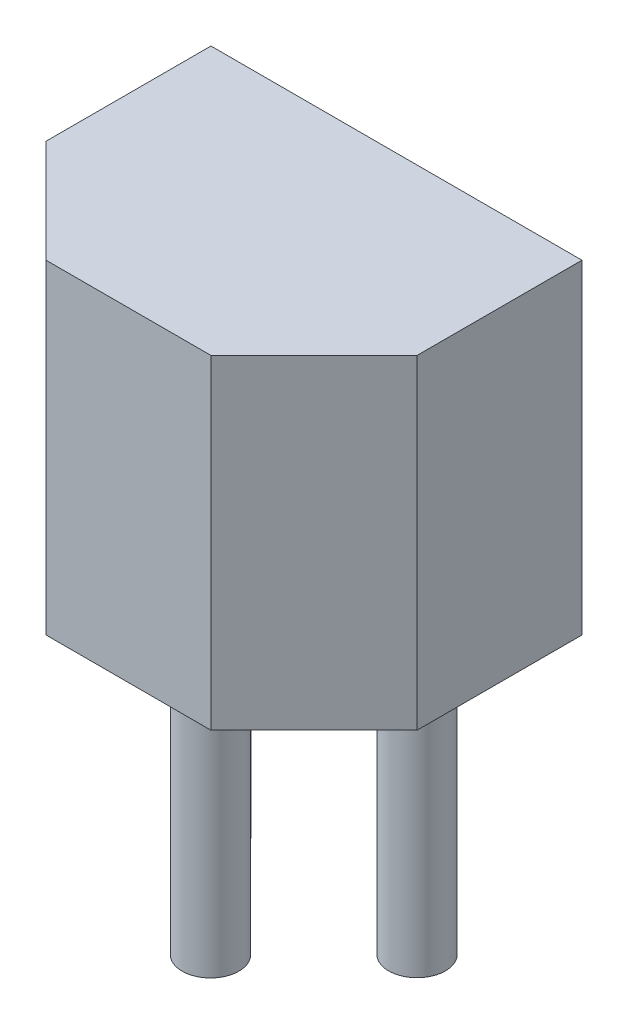
ISO-10303-21;
HEADER;
FILE_DESCRIPTION(('STEP AP214'),'2;1');
FILE_NAME('part.step','',(''),(''),'','','');
FILE_SCHEMA(('AUTOMOTIVE_DESIGN { 1 0 10303 214 1 1 1 1 }'));
ENDSEC;
DATA;
#1=APPLICATION_CONTEXT('core data for automotive mechanical design processes');
#2=APPLICATION_PROTOCOL_DEFINITION('international standard','automotive_design',2000,#1);
#3=PRODUCT_CONTEXT('',#1,'mechanical');
#4=PRODUCT('Part','Part','',(#3));
#5=PRODUCT_RELATED_PRODUCT_CATEGORY('part','',(#4));
#6=PRODUCT_DEFINITION_FORMATION('','',#4);
#7=PRODUCT_DEFINITION_CONTEXT('part definition',#1,'design');
#8=PRODUCT_DEFINITION('design','',#6,#7);
#9=PRODUCT_DEFINITION_SHAPE('','',#8);
#10=(LENGTH_UNIT() NAMED_UNIT(*) SI_UNIT(.MILLI.,.METRE.));
#11=(NAMED_UNIT(*) PLANE_ANGLE_UNIT() SI_UNIT($,.RADIAN.));
#12=(NAMED_UNIT(*) SI_UNIT($,.STERADIAN.) SOLID_ANGLE_UNIT());
#13=UNCERTAINTY_MEASURE_WITH_UNIT(LENGTH_MEASURE(1.E-05),#10,'distance_accuracy_value','');
#14=(GEOMETRIC_REPRESENTATION_CONTEXT(3) GLOBAL_UNCERTAINTY_ASSIGNED_CONTEXT((#13)) GLOBAL_UNIT_ASSIGNED_CONTEXT((#10,
#11,#12)) REPRESENTATION_CONTEXT('',''));
#15=CARTESIAN_POINT('',(0.,0.,0.));
#16=DIRECTION('',(0.,0.,1.));
#17=DIRECTION('',(1.,0.,0.));
#18=AXIS2_PLACEMENT_3D('',#15,#16,#17);
#19=CARTESIAN_POINT('',(-1.016,0.,-1.016));
#20=DIRECTION('',(0.,-1.,0.));
#21=DIRECTION('',(0.,0.,-1.));
#22=AXIS2_PLACEMENT_3D('',#19,#20,#21);
#23=PLANE('',#22);
#24=CARTESIAN_POINT('',(2.54,0.,0.));
#25=DIRECTION('',(0.,-1.,0.));
#26=DIRECTION('',(0.,0.,-1.));
#27=AXIS2_PLACEMENT_3D('',#24,#25,#26);
#28=CIRCLE('',#27,0.35);
#29=CARTESIAN_POINT('',(2.54,0.,-0.35));
#30=VERTEX_POINT('',#29);
#31=EDGE_CURVE('E186',#30,#30,#28,.T.);
#32=ORIENTED_EDGE('',*,*,#31,.F.);
#33=EDGE_LOOP('',(#32));
#34=FACE_BOUND('',#33,.T.);
#35=DIRECTION('',(0.,0.,1.));
#36=VECTOR('',#35,1.);
#37=CARTESIAN_POINT('',(-1.016,0.,1.016));
#38=LINE('',#37,#36);
#39=CARTESIAN_POINT('',(-1.016,0.,-1.016));
#40=VERTEX_POINT('',#39);
#41=CARTESIAN_POINT('',(-1.016,0.,1.016));
#42=VERTEX_POINT('',#41);
#43=EDGE_CURVE('E116',#40,#42,#38,.T.);
#44=ORIENTED_EDGE('',*,*,#43,.F.);
#45=DIRECTION('',(-1.,0.,0.));
#46=VECTOR('',#45,1.);
#47=CARTESIAN_POINT('',(-1.016,0.,-1.016));
#48=LINE('',#47,#46);
#49=CARTESIAN_POINT('',(3.556,0.,-1.016));
#50=VERTEX_POINT('',#49);
#51=EDGE_CURVE('E77',#50,#40,#48,.T.);
#52=ORIENTED_EDGE('',*,*,#51,.F.);
#53=DIRECTION('',(0.,0.,-1.));
#54=VECTOR('',#53,1.);
#55=CARTESIAN_POINT('',(3.556,0.,1.016));
#56=LINE('',#55,#54);
#57=CARTESIAN_POINT('',(3.556,0.,1.016));
#58=VERTEX_POINT('',#57);
#59=EDGE_CURVE('E71',#58,#50,#56,.T.);
#60=ORIENTED_EDGE('',*,*,#59,.F.);
#61=DIRECTION('',(0.707106781186547,0.,-0.707106781186547));
#62=VECTOR('',#61,1.);
#63=CARTESIAN_POINT('',(2.286,0.,2.286));
#64=LINE('',#63,#62);
#65=CARTESIAN_POINT('',(2.286,0.,2.286));
#66=VERTEX_POINT('',#65);
#67=EDGE_CURVE('E106',#66,#58,#64,.T.);
#68=ORIENTED_EDGE('',*,*,#67,.F.);
#69=DIRECTION('',(1.,0.,0.));
#70=VECTOR('',#69,1.);
#71=CARTESIAN_POINT('',(0.254,0.,2.286));
#72=LINE('',#71,#70);
#73=CARTESIAN_POINT('',(0.254,0.,2.286));
#74=VERTEX_POINT('',#73);
#75=EDGE_CURVE('E122',#74,#66,#72,.T.);
#76=ORIENTED_EDGE('',*,*,#75,.F.);
#77=DIRECTION('',(0.707106781186547,0.,0.707106781186547));
#78=VECTOR('',#77,1.);
#79=CARTESIAN_POINT('',(-1.016,0.,1.016));
#80=LINE('',#79,#78);
#81=EDGE_CURVE('E119',#42,#74,#80,.T.);
#82=ORIENTED_EDGE('',*,*,#81,.F.);
#83=EDGE_LOOP('',(#44,#52,#60,#68,#76,#82));
#84=FACE_BOUND('',#83,.T.);
#85=CARTESIAN_POINT('',(0.,0.,0.));
#86=DIRECTION('',(0.,-1.,0.));
#87=DIRECTION('',(0.,0.,-1.));
#88=AXIS2_PLACEMENT_3D('',#85,#86,#87);
#89=CIRCLE('',#88,0.35);
#90=CARTESIAN_POINT('',(0.,0.,-0.35));
#91=VERTEX_POINT('',#90);
#92=EDGE_CURVE('E196',#91,#91,#89,.T.);
#93=ORIENTED_EDGE('',*,*,#92,.F.);
#94=EDGE_LOOP('',(#93));
#95=FACE_BOUND('',#94,.T.);
#96=CARTESIAN_POINT('',(1.27,0.,1.27557830022308));
#97=DIRECTION('',(0.,-1.,0.));
#98=DIRECTION('',(0.,0.,-1.));
#99=AXIS2_PLACEMENT_3D('',#96,#97,#98);
#100=CIRCLE('',#99,0.35);
#101=CARTESIAN_POINT('',(1.27,0.,0.925578300223079));
#102=VERTEX_POINT('',#101);
#103=EDGE_CURVE('E187',#102,#102,#100,.T.);
#104=ORIENTED_EDGE('',*,*,#103,.F.);
#105=EDGE_LOOP('',(#104));
#106=FACE_BOUND('',#105,.T.);
#107=ADVANCED_FACE('F31',(#34,#84,#95,#106),#23,.T.);
#108=CARTESIAN_POINT('',(-1.016,4.,1.016));
#109=DIRECTION('',(1.,0.,0.));
#110=DIRECTION('',(0.,0.,-1.));
#111=AXIS2_PLACEMENT_3D('',#108,#109,#110);
#112=PLANE('',#111);
#113=ORIENTED_EDGE('',*,*,#43,.T.);
#114=DIRECTION('',(0.,-1.,0.));
#115=VECTOR('',#114,1.);
#116=CARTESIAN_POINT('',(-1.016,4.,1.016));
#117=LINE('',#116,#115);
#118=CARTESIAN_POINT('',(-1.016,4.,1.016));
#119=VERTEX_POINT('',#118);
#120=EDGE_CURVE('E11',#119,#42,#117,.T.);
#121=ORIENTED_EDGE('',*,*,#120,.F.);
#122=DIRECTION('',(0.,0.,1.));
#123=VECTOR('',#122,1.);
#124=CARTESIAN_POINT('',(-1.016,4.,1.016));
#125=LINE('',#124,#123);
#126=CARTESIAN_POINT('',(-1.016,4.,-1.016));
#127=VERTEX_POINT('',#126);
#128=EDGE_CURVE('E127',#127,#119,#125,.T.);
#129=ORIENTED_EDGE('',*,*,#128,.F.);
#130=DIRECTION('',(0.,-1.,0.));
#131=VECTOR('',#130,1.);
#132=CARTESIAN_POINT('',(-1.016,4.,-1.016));
#133=LINE('',#132,#131);
#134=EDGE_CURVE('E112',#127,#40,#133,.T.);
#135=ORIENTED_EDGE('',*,*,#134,.T.);
#136=EDGE_LOOP('',(#113,#121,#129,#135));
#137=FACE_BOUND('',#136,.T.);
#138=ADVANCED_FACE('F33',(#137),#112,.F.);
#139=CARTESIAN_POINT('',(-1.016,4.,1.016));
#140=DIRECTION('',(0.707106781186547,0.,-0.707106781186547));
#141=DIRECTION('',(-0.707106781186548,0.,-0.707106781186548));
#142=AXIS2_PLACEMENT_3D('',#139,#140,#141);
#143=PLANE('',#142);
#144=ORIENTED_EDGE('',*,*,#81,.T.);
#145=DIRECTION('',(0.,-1.,0.));
#146=VECTOR('',#145,1.);
#147=CARTESIAN_POINT('',(0.254,4.,2.286));
#148=LINE('',#147,#146);
#149=CARTESIAN_POINT('',(0.254,4.,2.286));
#150=VERTEX_POINT('',#149);
#151=EDGE_CURVE('E40',#150,#74,#148,.T.);
#152=ORIENTED_EDGE('',*,*,#151,.F.);
#153=DIRECTION('',(0.707106781186547,0.,0.707106781186547));
#154=VECTOR('',#153,1.);
#155=CARTESIAN_POINT('',(-1.016,4.,1.016));
#156=LINE('',#155,#154);
#157=EDGE_CURVE('E85',#119,#150,#156,.T.);
#158=ORIENTED_EDGE('',*,*,#157,.F.);
#159=ORIENTED_EDGE('',*,*,#120,.T.);
#160=EDGE_LOOP('',(#144,#152,#158,#159));
#161=FACE_BOUND('',#160,.T.);
#162=ADVANCED_FACE('F156',(#161),#143,.F.);
#163=CARTESIAN_POINT('',(0.254,4.,2.286));
#164=DIRECTION('',(0.,0.,-1.));
#165=DIRECTION('',(-1.,0.,0.));
#166=AXIS2_PLACEMENT_3D('',#163,#164,#165);
#167=PLANE('',#166);
#168=ORIENTED_EDGE('',*,*,#75,.T.);
#169=DIRECTION('',(0.,-1.,0.));
#170=VECTOR('',#169,1.);
#171=CARTESIAN_POINT('',(2.286,4.,2.286));
#172=LINE('',#171,#170);
#173=CARTESIAN_POINT('',(2.286,4.,2.286));
#174=VERTEX_POINT('',#173);
#175=EDGE_CURVE('E107',#174,#66,#172,.T.);
#176=ORIENTED_EDGE('',*,*,#175,.F.);
#177=DIRECTION('',(1.,0.,0.));
#178=VECTOR('',#177,1.);
#179=CARTESIAN_POINT('',(0.254,4.,2.286));
#180=LINE('',#179,#178);
#181=EDGE_CURVE('E98',#150,#174,#180,.T.);
#182=ORIENTED_EDGE('',*,*,#181,.F.);
#183=ORIENTED_EDGE('',*,*,#151,.T.);
#184=EDGE_LOOP('',(#168,#176,#182,#183));
#185=FACE_BOUND('',#184,.T.);
#186=ADVANCED_FACE('F133',(#185),#167,.F.);
#187=CARTESIAN_POINT('',(2.286,4.,2.286));
#188=DIRECTION('',(-0.707106781186547,0.,-0.707106781186547));
#189=DIRECTION('',(-0.707106781186548,0.,0.707106781186548));
#190=AXIS2_PLACEMENT_3D('',#187,#188,#189);
#191=PLANE('',#190);
#192=ORIENTED_EDGE('',*,*,#67,.T.);
#193=DIRECTION('',(0.,-1.,0.));
#194=VECTOR('',#193,1.);
#195=CARTESIAN_POINT('',(3.556,4.,1.016));
#196=LINE('',#195,#194);
#197=CARTESIAN_POINT('',(3.556,4.,1.016));
#198=VERTEX_POINT('',#197);
#199=EDGE_CURVE('E103',#198,#58,#196,.T.);
#200=ORIENTED_EDGE('',*,*,#199,.F.);
#201=DIRECTION('',(0.707106781186547,0.,-0.707106781186547));
#202=VECTOR('',#201,1.);
#203=CARTESIAN_POINT('',(2.286,4.,2.286));
#204=LINE('',#203,#202);
#205=EDGE_CURVE('E92',#174,#198,#204,.T.);
#206=ORIENTED_EDGE('',*,*,#205,.F.);
#207=ORIENTED_EDGE('',*,*,#175,.T.);
#208=EDGE_LOOP('',(#192,#200,#206,#207));
#209=FACE_BOUND('',#208,.T.);
#210=ADVANCED_FACE('F104',(#209),#191,.F.);
#211=CARTESIAN_POINT('',(3.556,4.,1.016));
#212=DIRECTION('',(-1.,0.,0.));
#213=DIRECTION('',(0.,0.,1.));
#214=AXIS2_PLACEMENT_3D('',#211,#212,#213);
#215=PLANE('',#214);
#216=ORIENTED_EDGE('',*,*,#59,.T.);
#217=DIRECTION('',(0.,-1.,0.));
#218=VECTOR('',#217,1.);
#219=CARTESIAN_POINT('',(3.556,4.,-1.016));
#220=LINE('',#219,#218);
#221=CARTESIAN_POINT('',(3.556,4.,-1.016));
#222=VERTEX_POINT('',#221);
#223=EDGE_CURVE('E108',#222,#50,#220,.T.);
#224=ORIENTED_EDGE('',*,*,#223,.F.);
#225=DIRECTION('',(0.,0.,-1.));
#226=VECTOR('',#225,1.);
#227=CARTESIAN_POINT('',(3.556,4.,1.016));
#228=LINE('',#227,#226);
#229=EDGE_CURVE('E96',#198,#222,#228,.T.);
#230=ORIENTED_EDGE('',*,*,#229,.F.);
#231=ORIENTED_EDGE('',*,*,#199,.T.);
#232=EDGE_LOOP('',(#216,#224,#230,#231));
#233=FACE_BOUND('',#232,.T.);
#234=ADVANCED_FACE('F110',(#233),#215,.F.);
#235=CARTESIAN_POINT('',(-1.016,4.,-1.016));
#236=DIRECTION('',(0.,0.,1.));
#237=DIRECTION('',(1.,0.,0.));
#238=AXIS2_PLACEMENT_3D('',#235,#236,#237);
#239=PLANE('',#238);
#240=ORIENTED_EDGE('',*,*,#51,.T.);
#241=ORIENTED_EDGE('',*,*,#134,.F.);
#242=DIRECTION('',(-1.,0.,0.));
#243=VECTOR('',#242,1.);
#244=CARTESIAN_POINT('',(-1.016,4.,-1.016));
#245=LINE('',#244,#243);
#246=EDGE_CURVE('E48',#222,#127,#245,.T.);
#247=ORIENTED_EDGE('',*,*,#246,.F.);
#248=ORIENTED_EDGE('',*,*,#223,.T.);
#249=EDGE_LOOP('',(#240,#241,#247,#248));
#250=FACE_BOUND('',#249,.T.);
#251=ADVANCED_FACE('F140',(#250),#239,.F.);
#252=CARTESIAN_POINT('',(-1.016,4.,-1.016));
#253=DIRECTION('',(0.,-1.,0.));
#254=DIRECTION('',(0.,0.,-1.));
#255=AXIS2_PLACEMENT_3D('',#252,#253,#254);
#256=PLANE('',#255);
#257=ORIENTED_EDGE('',*,*,#128,.T.);
#258=ORIENTED_EDGE('',*,*,#157,.T.);
#259=ORIENTED_EDGE('',*,*,#181,.T.);
#260=ORIENTED_EDGE('',*,*,#205,.T.);
#261=ORIENTED_EDGE('',*,*,#229,.T.);
#262=ORIENTED_EDGE('',*,*,#246,.T.);
#263=EDGE_LOOP('',(#257,#258,#259,#260,#261,#262));
#264=FACE_BOUND('',#263,.T.);
#265=ADVANCED_FACE('F94',(#264),#256,.F.);
#266=CARTESIAN_POINT('',(0.,-3.41,0.));
#267=DIRECTION('',(0.,1.,0.));
#268=DIRECTION('',(0.,0.,1.));
#269=AXIS2_PLACEMENT_3D('',#266,#267,#268);
#270=CYLINDRICAL_SURFACE('',#269,0.35);
#271=CARTESIAN_POINT('',(0.,-3.41,0.));
#272=DIRECTION('',(0.,-1.,0.));
#273=DIRECTION('',(0.,0.,-1.));
#274=AXIS2_PLACEMENT_3D('',#271,#272,#273);
#275=CIRCLE('',#274,0.35);
#276=CARTESIAN_POINT('',(0.,-3.41,-0.35));
#277=VERTEX_POINT('',#276);
#278=EDGE_CURVE('E120',#277,#277,#275,.T.);
#279=ORIENTED_EDGE('',*,*,#278,.F.);
#280=EDGE_LOOP('',(#279));
#281=FACE_BOUND('',#280,.T.);
#282=ORIENTED_EDGE('',*,*,#92,.T.);
#283=EDGE_LOOP('',(#282));
#284=FACE_BOUND('',#283,.T.);
#285=ADVANCED_FACE('F147',(#281,#284),#270,.T.);
#286=CARTESIAN_POINT('',(0.,-3.41,0.));
#287=DIRECTION('',(0.,-1.,0.));
#288=DIRECTION('',(0.,0.,-1.));
#289=AXIS2_PLACEMENT_3D('',#286,#287,#288);
#290=PLANE('',#289);
#291=ORIENTED_EDGE('',*,*,#278,.T.);
#292=EDGE_LOOP('',(#291));
#293=FACE_BOUND('',#292,.T.);
#294=ADVANCED_FACE('F161',(#293),#290,.T.);
#295=CARTESIAN_POINT('',(2.54,-3.41,0.));
#296=DIRECTION('',(0.,1.,0.));
#297=DIRECTION('',(0.,0.,1.));
#298=AXIS2_PLACEMENT_3D('',#295,#296,#297);
#299=CYLINDRICAL_SURFACE('',#298,0.35);
#300=CARTESIAN_POINT('',(2.54,-3.41,0.));
#301=DIRECTION('',(0.,-1.,0.));
#302=DIRECTION('',(0.,0.,-1.));
#303=AXIS2_PLACEMENT_3D('',#300,#301,#302);
#304=CIRCLE('',#303,0.35);
#305=CARTESIAN_POINT('',(2.54,-3.41,-0.35));
#306=VERTEX_POINT('',#305);
#307=EDGE_CURVE('E190',#306,#306,#304,.T.);
#308=ORIENTED_EDGE('',*,*,#307,.F.);
#309=EDGE_LOOP('',(#308));
#310=FACE_BOUND('',#309,.T.);
#311=ORIENTED_EDGE('',*,*,#31,.T.);
#312=EDGE_LOOP('',(#311));
#313=FACE_BOUND('',#312,.T.);
#314=ADVANCED_FACE('F165',(#310,#313),#299,.T.);
#315=CARTESIAN_POINT('',(2.54,-3.41,0.));
#316=DIRECTION('',(0.,-1.,0.));
#317=DIRECTION('',(0.,0.,-1.));
#318=AXIS2_PLACEMENT_3D('',#315,#316,#317);
#319=PLANE('',#318);
#320=ORIENTED_EDGE('',*,*,#307,.T.);
#321=EDGE_LOOP('',(#320));
#322=FACE_BOUND('',#321,.T.);
#323=ADVANCED_FACE('F169',(#322),#319,.T.);
#324=CARTESIAN_POINT('',(1.27,-3.41,1.27557830022308));
#325=DIRECTION('',(0.,1.,0.));
#326=DIRECTION('',(0.,0.,1.));
#327=AXIS2_PLACEMENT_3D('',#324,#325,#326);
#328=CYLINDRICAL_SURFACE('',#327,0.35);
#329=CARTESIAN_POINT('',(1.27,-3.41,1.27557830022308));
#330=DIRECTION('',(0.,-1.,0.));
#331=DIRECTION('',(0.,0.,-1.));
#332=AXIS2_PLACEMENT_3D('',#329,#330,#331);
#333=CIRCLE('',#332,0.35);
#334=CARTESIAN_POINT('',(1.27,-3.41,0.925578300223079));
#335=VERTEX_POINT('',#334);
#336=EDGE_CURVE('E185',#335,#335,#333,.T.);
#337=ORIENTED_EDGE('',*,*,#336,.F.);
#338=EDGE_LOOP('',(#337));
#339=FACE_BOUND('',#338,.T.);
#340=ORIENTED_EDGE('',*,*,#103,.T.);
#341=EDGE_LOOP('',(#340));
#342=FACE_BOUND('',#341,.T.);
#343=ADVANCED_FACE('F173',(#339,#342),#328,.T.);
#344=CARTESIAN_POINT('',(1.27,-3.41,1.27557830022308));
#345=DIRECTION('',(0.,-1.,0.));
#346=DIRECTION('',(0.,0.,-1.));
#347=AXIS2_PLACEMENT_3D('',#344,#345,#346);
#348=PLANE('',#347);
#349=ORIENTED_EDGE('',*,*,#336,.T.);
#350=EDGE_LOOP('',(#349));
#351=FACE_BOUND('',#350,.T.);
#352=ADVANCED_FACE('F177',(#351),#348,.T.);
#353=CLOSED_SHELL('',(#107,#138,#162,#186,#210,#234,#251,#265,#285,#294,#314,#323,#343,#352));
#354=MANIFOLD_SOLID_BREP('B2',#353);
#355=ADVANCED_BREP_SHAPE_REPRESENTATION('',(#18,#354),#14);
#356=SHAPE_DEFINITION_REPRESENTATION(#9,#355);
ENDSEC;
END-ISO-10303-21;
